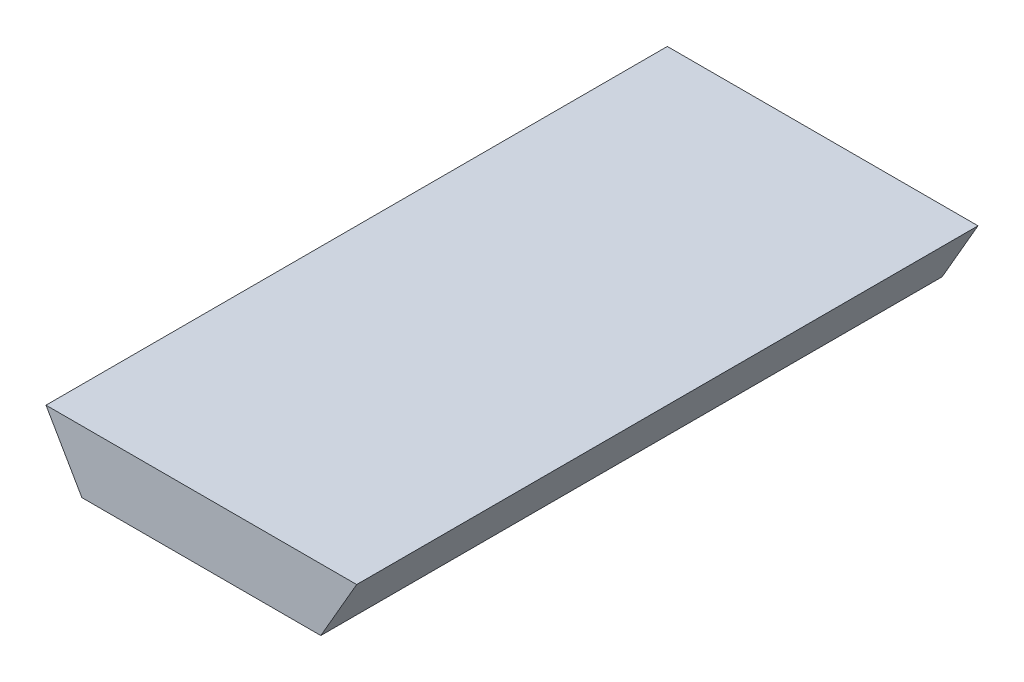
ISO-10303-21;
HEADER;
FILE_DESCRIPTION(('STEP AP214'),'2;1');
FILE_NAME('part.step','',(''),(''),'','','');
FILE_SCHEMA(('AUTOMOTIVE_DESIGN { 1 0 10303 214 1 1 1 1 }'));
ENDSEC;
DATA;
#1=APPLICATION_CONTEXT('core data for automotive mechanical design processes');
#2=APPLICATION_PROTOCOL_DEFINITION('international standard','automotive_design',2000,#1);
#3=PRODUCT_CONTEXT('',#1,'mechanical');
#4=PRODUCT('Part','Part','',(#3));
#5=PRODUCT_RELATED_PRODUCT_CATEGORY('part','',(#4));
#6=PRODUCT_DEFINITION_FORMATION('','',#4);
#7=PRODUCT_DEFINITION_CONTEXT('part definition',#1,'design');
#8=PRODUCT_DEFINITION('design','',#6,#7);
#9=PRODUCT_DEFINITION_SHAPE('','',#8);
#10=(LENGTH_UNIT() NAMED_UNIT(*) SI_UNIT(.MILLI.,.METRE.));
#11=(NAMED_UNIT(*) PLANE_ANGLE_UNIT() SI_UNIT($,.RADIAN.));
#12=(NAMED_UNIT(*) SI_UNIT($,.STERADIAN.) SOLID_ANGLE_UNIT());
#13=UNCERTAINTY_MEASURE_WITH_UNIT(LENGTH_MEASURE(1.E-05),#10,'distance_accuracy_value','');
#14=(GEOMETRIC_REPRESENTATION_CONTEXT(3) GLOBAL_UNCERTAINTY_ASSIGNED_CONTEXT((#13)) GLOBAL_UNIT_ASSIGNED_CONTEXT((#10,
#11,#12)) REPRESENTATION_CONTEXT('',''));
#15=CARTESIAN_POINT('',(0.,0.,0.));
#16=DIRECTION('',(0.,0.,1.));
#17=DIRECTION('',(1.,0.,0.));
#18=AXIS2_PLACEMENT_3D('',#15,#16,#17);
#19=CARTESIAN_POINT('',(0.,0.,5.));
#20=DIRECTION('',(0.,1.,0.));
#21=DIRECTION('',(0.,0.,1.));
#22=AXIS2_PLACEMENT_3D('',#19,#20,#21);
#23=PLANE('',#22);
#24=DIRECTION('',(1.,0.,0.));
#25=VECTOR('',#24,1.);
#26=CARTESIAN_POINT('',(0.,0.,0.));
#27=LINE('',#26,#25);
#28=CARTESIAN_POINT('',(-0.961324865405186,0.,0.));
#29=VERTEX_POINT('',#28);
#30=CARTESIAN_POINT('',(0.961324865405187,0.,0.));
#31=VERTEX_POINT('',#30);
#32=EDGE_CURVE('E100',#29,#31,#27,.T.);
#33=ORIENTED_EDGE('',*,*,#32,.T.);
#34=DIRECTION('',(0.,0.,-1.));
#35=VECTOR('',#34,1.);
#36=CARTESIAN_POINT('',(0.961324865405187,0.,5.));
#37=LINE('',#36,#35);
#38=CARTESIAN_POINT('',(0.961324865405187,0.,5.));
#39=VERTEX_POINT('',#38);
#40=EDGE_CURVE('E11',#39,#31,#37,.T.);
#41=ORIENTED_EDGE('',*,*,#40,.F.);
#42=DIRECTION('',(1.,0.,0.));
#43=VECTOR('',#42,1.);
#44=CARTESIAN_POINT('',(0.,0.,5.));
#45=LINE('',#44,#43);
#46=CARTESIAN_POINT('',(-0.961324865405186,0.,5.));
#47=VERTEX_POINT('',#46);
#48=EDGE_CURVE('E88',#47,#39,#45,.T.);
#49=ORIENTED_EDGE('',*,*,#48,.F.);
#50=DIRECTION('',(0.,0.,-1.));
#51=VECTOR('',#50,1.);
#52=CARTESIAN_POINT('',(-0.961324865405186,0.,5.));
#53=LINE('',#52,#51);
#54=EDGE_CURVE('E96',#47,#29,#53,.T.);
#55=ORIENTED_EDGE('',*,*,#54,.T.);
#56=EDGE_LOOP('',(#33,#41,#49,#55));
#57=FACE_BOUND('',#56,.T.);
#58=ADVANCED_FACE('F37',(#57),#23,.F.);
#59=CARTESIAN_POINT('',(0.72099364905389,-0.416265877365274,5.));
#60=DIRECTION('',(-0.866025403784439,0.5,0.));
#61=DIRECTION('',(-0.5,-0.866025403784439,0.));
#62=AXIS2_PLACEMENT_3D('',#59,#60,#61);
#63=PLANE('',#62);
#64=DIRECTION('',(0.5,0.866025403784439,0.));
#65=VECTOR('',#64,1.);
#66=CARTESIAN_POINT('',(0.72099364905389,-0.416265877365274,0.));
#67=LINE('',#66,#65);
#68=CARTESIAN_POINT('',(1.25,0.5,0.));
#69=VERTEX_POINT('',#68);
#70=EDGE_CURVE('E92',#31,#69,#67,.T.);
#71=ORIENTED_EDGE('',*,*,#70,.T.);
#72=DIRECTION('',(0.,0.,-1.));
#73=VECTOR('',#72,1.);
#74=CARTESIAN_POINT('',(1.25,0.5,5.));
#75=LINE('',#74,#73);
#76=CARTESIAN_POINT('',(1.25,0.5,5.));
#77=VERTEX_POINT('',#76);
#78=EDGE_CURVE('E45',#77,#69,#75,.T.);
#79=ORIENTED_EDGE('',*,*,#78,.F.);
#80=DIRECTION('',(0.5,0.866025403784439,0.));
#81=VECTOR('',#80,1.);
#82=CARTESIAN_POINT('',(0.72099364905389,-0.416265877365274,5.));
#83=LINE('',#82,#81);
#84=EDGE_CURVE('E83',#39,#77,#83,.T.);
#85=ORIENTED_EDGE('',*,*,#84,.F.);
#86=ORIENTED_EDGE('',*,*,#40,.T.);
#87=EDGE_LOOP('',(#71,#79,#85,#86));
#88=FACE_BOUND('',#87,.T.);
#89=ADVANCED_FACE('F91',(#88),#63,.F.);
#90=CARTESIAN_POINT('',(0.,0.500000000000001,5.));
#91=DIRECTION('',(0.,-1.,0.));
#92=DIRECTION('',(1.,0.,0.));
#93=AXIS2_PLACEMENT_3D('',#90,#91,#92);
#94=PLANE('',#93);
#95=DIRECTION('',(-1.,0.,0.));
#96=VECTOR('',#95,1.);
#97=CARTESIAN_POINT('',(0.,0.500000000000001,0.));
#98=LINE('',#97,#96);
#99=CARTESIAN_POINT('',(-1.25,0.500000000000001,0.));
#100=VERTEX_POINT('',#99);
#101=EDGE_CURVE('E70',#69,#100,#98,.T.);
#102=ORIENTED_EDGE('',*,*,#101,.T.);
#103=DIRECTION('',(0.,0.,-1.));
#104=VECTOR('',#103,1.);
#105=CARTESIAN_POINT('',(-1.25,0.500000000000001,5.));
#106=LINE('',#105,#104);
#107=CARTESIAN_POINT('',(-1.25,0.500000000000001,5.));
#108=VERTEX_POINT('',#107);
#109=EDGE_CURVE('E93',#108,#100,#106,.T.);
#110=ORIENTED_EDGE('',*,*,#109,.F.);
#111=DIRECTION('',(-1.,0.,0.));
#112=VECTOR('',#111,1.);
#113=CARTESIAN_POINT('',(0.,0.500000000000001,5.));
#114=LINE('',#113,#112);
#115=EDGE_CURVE('E86',#77,#108,#114,.T.);
#116=ORIENTED_EDGE('',*,*,#115,.F.);
#117=ORIENTED_EDGE('',*,*,#78,.T.);
#118=EDGE_LOOP('',(#102,#110,#116,#117));
#119=FACE_BOUND('',#118,.T.);
#120=ADVANCED_FACE('F94',(#119),#94,.F.);
#121=CARTESIAN_POINT('',(-0.72099364905389,-0.416265877365273,5.));
#122=DIRECTION('',(0.866025403784439,0.5,0.));
#123=DIRECTION('',(-0.5,0.866025403784439,0.));
#124=AXIS2_PLACEMENT_3D('',#121,#122,#123);
#125=PLANE('',#124);
#126=DIRECTION('',(0.5,-0.866025403784439,0.));
#127=VECTOR('',#126,1.);
#128=CARTESIAN_POINT('',(-0.72099364905389,-0.416265877365273,0.));
#129=LINE('',#128,#127);
#130=EDGE_CURVE('E76',#100,#29,#129,.T.);
#131=ORIENTED_EDGE('',*,*,#130,.T.);
#132=ORIENTED_EDGE('',*,*,#54,.F.);
#133=DIRECTION('',(0.5,-0.866025403784439,0.));
#134=VECTOR('',#133,1.);
#135=CARTESIAN_POINT('',(-0.72099364905389,-0.416265877365273,5.));
#136=LINE('',#135,#134);
#137=EDGE_CURVE('E53',#108,#47,#136,.T.);
#138=ORIENTED_EDGE('',*,*,#137,.F.);
#139=ORIENTED_EDGE('',*,*,#109,.T.);
#140=EDGE_LOOP('',(#131,#132,#138,#139));
#141=FACE_BOUND('',#140,.T.);
#142=ADVANCED_FACE('F107',(#141),#125,.F.);
#143=CARTESIAN_POINT('',(0.,0.,5.));
#144=DIRECTION('',(0.,0.,1.));
#145=DIRECTION('',(1.,0.,0.));
#146=AXIS2_PLACEMENT_3D('',#143,#144,#145);
#147=PLANE('',#146);
#148=ORIENTED_EDGE('',*,*,#48,.T.);
#149=ORIENTED_EDGE('',*,*,#84,.T.);
#150=ORIENTED_EDGE('',*,*,#115,.T.);
#151=ORIENTED_EDGE('',*,*,#137,.T.);
#152=EDGE_LOOP('',(#148,#149,#150,#151));
#153=FACE_BOUND('',#152,.T.);
#154=ADVANCED_FACE('F84',(#153),#147,.T.);
#155=CARTESIAN_POINT('',(0.,0.,0.));
#156=DIRECTION('',(0.,0.,1.));
#157=DIRECTION('',(1.,0.,0.));
#158=AXIS2_PLACEMENT_3D('',#155,#156,#157);
#159=PLANE('',#158);
#160=ORIENTED_EDGE('',*,*,#32,.F.);
#161=ORIENTED_EDGE('',*,*,#130,.F.);
#162=ORIENTED_EDGE('',*,*,#101,.F.);
#163=ORIENTED_EDGE('',*,*,#70,.F.);
#164=EDGE_LOOP('',(#160,#161,#162,#163));
#165=FACE_BOUND('',#164,.T.);
#166=ADVANCED_FACE('F110',(#165),#159,.F.);
#167=CLOSED_SHELL('',(#58,#89,#120,#142,#154,#166));
#168=MANIFOLD_SOLID_BREP('B2',#167);
#169=ADVANCED_BREP_SHAPE_REPRESENTATION('',(#18,#168),#14);
#170=SHAPE_DEFINITION_REPRESENTATION(#9,#169);
ENDSEC;
END-ISO-10303-21;
